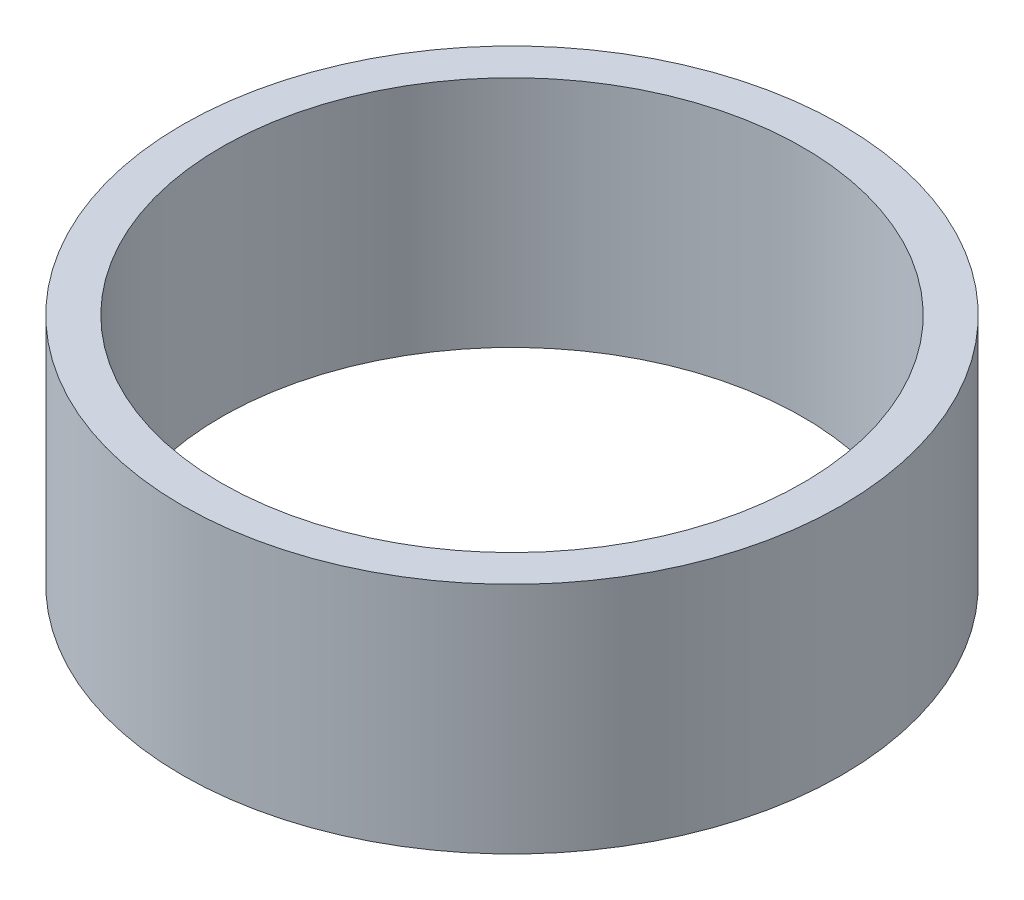
ISO-10303-21;
HEADER;
FILE_DESCRIPTION(('STEP AP214'),'2;1');
FILE_NAME('part.step','',(''),(''),'','','');
FILE_SCHEMA(('AUTOMOTIVE_DESIGN { 1 0 10303 214 1 1 1 1 }'));
ENDSEC;
DATA;
#1=APPLICATION_CONTEXT('core data for automotive mechanical design processes');
#2=APPLICATION_PROTOCOL_DEFINITION('international standard','automotive_design',2000,#1);
#3=PRODUCT_CONTEXT('',#1,'mechanical');
#4=PRODUCT('Part','Part','',(#3));
#5=PRODUCT_RELATED_PRODUCT_CATEGORY('part','',(#4));
#6=PRODUCT_DEFINITION_FORMATION('','',#4);
#7=PRODUCT_DEFINITION_CONTEXT('part definition',#1,'design');
#8=PRODUCT_DEFINITION('design','',#6,#7);
#9=PRODUCT_DEFINITION_SHAPE('','',#8);
#10=(LENGTH_UNIT() NAMED_UNIT(*) SI_UNIT(.MILLI.,.METRE.));
#11=(NAMED_UNIT(*) PLANE_ANGLE_UNIT() SI_UNIT($,.RADIAN.));
#12=(NAMED_UNIT(*) SI_UNIT($,.STERADIAN.) SOLID_ANGLE_UNIT());
#13=UNCERTAINTY_MEASURE_WITH_UNIT(LENGTH_MEASURE(1.E-05),#10,'distance_accuracy_value','');
#14=(GEOMETRIC_REPRESENTATION_CONTEXT(3) GLOBAL_UNCERTAINTY_ASSIGNED_CONTEXT((#13)) GLOBAL_UNIT_ASSIGNED_CONTEXT((#10,
#11,#12)) REPRESENTATION_CONTEXT('',''));
#15=CARTESIAN_POINT('',(0.,0.,0.));
#16=DIRECTION('',(0.,0.,1.));
#17=DIRECTION('',(1.,0.,0.));
#18=AXIS2_PLACEMENT_3D('',#15,#16,#17);
#19=CARTESIAN_POINT('',(0.,30.,0.));
#20=DIRECTION('',(0.,-1.,0.));
#21=DIRECTION('',(0.,0.,-1.));
#22=AXIS2_PLACEMENT_3D('',#19,#20,#21);
#23=CYLINDRICAL_SURFACE('',#22,42.35);
#24=CARTESIAN_POINT('',(0.,30.,0.));
#25=DIRECTION('',(0.,1.,0.));
#26=DIRECTION('',(0.,0.,1.));
#27=AXIS2_PLACEMENT_3D('',#24,#25,#26);
#28=CIRCLE('',#27,42.35);
#29=CARTESIAN_POINT('',(0.,30.,42.35));
#30=VERTEX_POINT('',#29);
#31=EDGE_CURVE('E46',#30,#30,#28,.T.);
#32=ORIENTED_EDGE('',*,*,#31,.F.);
#33=EDGE_LOOP('',(#32));
#34=FACE_BOUND('',#33,.T.);
#35=CARTESIAN_POINT('',(0.,0.,0.));
#36=DIRECTION('',(0.,1.,0.));
#37=DIRECTION('',(0.,0.,1.));
#38=AXIS2_PLACEMENT_3D('',#35,#36,#37);
#39=CIRCLE('',#38,42.35);
#40=CARTESIAN_POINT('',(0.,0.,42.35));
#41=VERTEX_POINT('',#40);
#42=EDGE_CURVE('E52',#41,#41,#39,.T.);
#43=ORIENTED_EDGE('',*,*,#42,.T.);
#44=EDGE_LOOP('',(#43));
#45=FACE_BOUND('',#44,.T.);
#46=ADVANCED_FACE('F39',(#34,#45),#23,.T.);
#47=CARTESIAN_POINT('',(0.,30.,0.));
#48=DIRECTION('',(0.,-1.,0.));
#49=DIRECTION('',(0.,0.,-1.));
#50=AXIS2_PLACEMENT_3D('',#47,#48,#49);
#51=CYLINDRICAL_SURFACE('',#50,37.35);
#52=CARTESIAN_POINT('',(0.,30.,0.));
#53=DIRECTION('',(0.,1.,0.));
#54=DIRECTION('',(0.,0.,1.));
#55=AXIS2_PLACEMENT_3D('',#52,#53,#54);
#56=CIRCLE('',#55,37.35);
#57=CARTESIAN_POINT('',(0.,30.,37.35));
#58=VERTEX_POINT('',#57);
#59=EDGE_CURVE('E10',#58,#58,#56,.T.);
#60=ORIENTED_EDGE('',*,*,#59,.T.);
#61=EDGE_LOOP('',(#60));
#62=FACE_BOUND('',#61,.T.);
#63=CARTESIAN_POINT('',(0.,0.,0.));
#64=DIRECTION('',(0.,1.,0.));
#65=DIRECTION('',(0.,0.,1.));
#66=AXIS2_PLACEMENT_3D('',#63,#64,#65);
#67=CIRCLE('',#66,37.35);
#68=CARTESIAN_POINT('',(0.,0.,37.35));
#69=VERTEX_POINT('',#68);
#70=EDGE_CURVE('E42',#69,#69,#67,.T.);
#71=ORIENTED_EDGE('',*,*,#70,.F.);
#72=EDGE_LOOP('',(#71));
#73=FACE_BOUND('',#72,.T.);
#74=ADVANCED_FACE('F61',(#62,#73),#51,.F.);
#75=CARTESIAN_POINT('',(0.,30.,0.));
#76=DIRECTION('',(0.,1.,0.));
#77=DIRECTION('',(0.,0.,1.));
#78=AXIS2_PLACEMENT_3D('',#75,#76,#77);
#79=PLANE('',#78);
#80=ORIENTED_EDGE('',*,*,#31,.T.);
#81=EDGE_LOOP('',(#80));
#82=FACE_BOUND('',#81,.T.);
#83=ORIENTED_EDGE('',*,*,#59,.F.);
#84=EDGE_LOOP('',(#83));
#85=FACE_BOUND('',#84,.T.);
#86=ADVANCED_FACE('F63',(#82,#85),#79,.T.);
#87=CARTESIAN_POINT('',(0.,0.,0.));
#88=DIRECTION('',(0.,1.,0.));
#89=DIRECTION('',(0.,0.,1.));
#90=AXIS2_PLACEMENT_3D('',#87,#88,#89);
#91=PLANE('',#90);
#92=ORIENTED_EDGE('',*,*,#42,.F.);
#93=EDGE_LOOP('',(#92));
#94=FACE_BOUND('',#93,.T.);
#95=ORIENTED_EDGE('',*,*,#70,.T.);
#96=EDGE_LOOP('',(#95));
#97=FACE_BOUND('',#96,.T.);
#98=ADVANCED_FACE('F59',(#94,#97),#91,.F.);
#99=CLOSED_SHELL('',(#46,#74,#86,#98));
#100=MANIFOLD_SOLID_BREP('B2',#99);
#101=ADVANCED_BREP_SHAPE_REPRESENTATION('',(#18,#100),#14);
#102=SHAPE_DEFINITION_REPRESENTATION(#9,#101);
ENDSEC;
END-ISO-10303-21;
